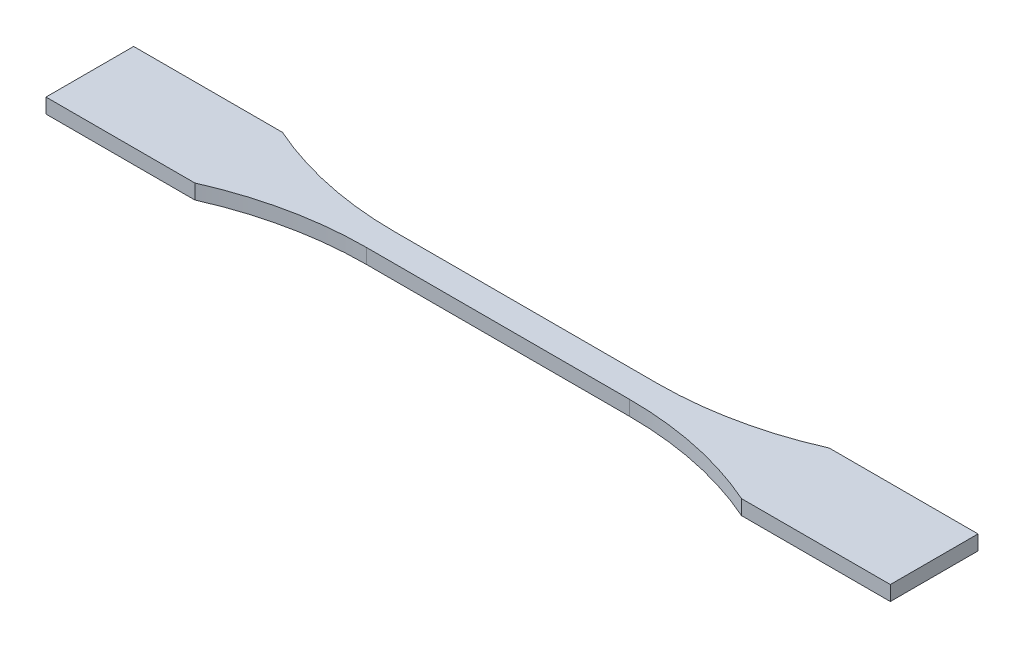
ISO-10303-21;
HEADER;
FILE_DESCRIPTION(('STEP AP214'),'2;1');
FILE_NAME('part.step','',(''),(''),'','','');
FILE_SCHEMA(('AUTOMOTIVE_DESIGN { 1 0 10303 214 1 1 1 1 }'));
ENDSEC;
DATA;
#1=APPLICATION_CONTEXT('core data for automotive mechanical design processes');
#2=APPLICATION_PROTOCOL_DEFINITION('international standard','automotive_design',2000,#1);
#3=PRODUCT_CONTEXT('',#1,'mechanical');
#4=PRODUCT('Part','Part','',(#3));
#5=PRODUCT_RELATED_PRODUCT_CATEGORY('part','',(#4));
#6=PRODUCT_DEFINITION_FORMATION('','',#4);
#7=PRODUCT_DEFINITION_CONTEXT('part definition',#1,'design');
#8=PRODUCT_DEFINITION('design','',#6,#7);
#9=PRODUCT_DEFINITION_SHAPE('','',#8);
#10=(LENGTH_UNIT() NAMED_UNIT(*) SI_UNIT(.MILLI.,.METRE.));
#11=(NAMED_UNIT(*) PLANE_ANGLE_UNIT() SI_UNIT($,.RADIAN.));
#12=(NAMED_UNIT(*) SI_UNIT($,.STERADIAN.) SOLID_ANGLE_UNIT());
#13=UNCERTAINTY_MEASURE_WITH_UNIT(LENGTH_MEASURE(1.E-05),#10,'distance_accuracy_value','');
#14=(GEOMETRIC_REPRESENTATION_CONTEXT(3) GLOBAL_UNCERTAINTY_ASSIGNED_CONTEXT((#13)) GLOBAL_UNIT_ASSIGNED_CONTEXT((#10,
#11,#12)) REPRESENTATION_CONTEXT('',''));
#15=CARTESIAN_POINT('',(0.,0.,0.));
#16=DIRECTION('',(0.,0.,1.));
#17=DIRECTION('',(1.,0.,0.));
#18=AXIS2_PLACEMENT_3D('',#15,#16,#17);
#19=CARTESIAN_POINT('',(-28.4999999999999,1.6,79.));
#20=DIRECTION('',(0.,-1.,0.));
#21=DIRECTION('',(0.,0.,-1.));
#22=AXIS2_PLACEMENT_3D('',#19,#20,#21);
#23=CYLINDRICAL_SURFACE('',#22,76.);
#24=CARTESIAN_POINT('',(-28.4999999999999,-1.6,79.));
#25=DIRECTION('',(0.,1.,0.));
#26=DIRECTION('',(0.,0.,1.));
#27=AXIS2_PLACEMENT_3D('',#24,#25,#26);
#28=CIRCLE('',#27,76.);
#29=CARTESIAN_POINT('',(-28.4999999999999,-1.6,3.));
#30=VERTEX_POINT('',#29);
#31=CARTESIAN_POINT('',(-59.2530486293635,-1.6,9.5));
#32=VERTEX_POINT('',#31);
#33=EDGE_CURVE('E154',#30,#32,#28,.T.);
#34=ORIENTED_EDGE('',*,*,#33,.F.);
#35=DIRECTION('',(0.,-1.,0.));
#36=VECTOR('',#35,1.);
#37=CARTESIAN_POINT('',(-28.4999999999999,1.6,3.));
#38=LINE('',#37,#36);
#39=CARTESIAN_POINT('',(-28.4999999999999,1.6,3.));
#40=VERTEX_POINT('',#39);
#41=EDGE_CURVE('E11',#40,#30,#38,.T.);
#42=ORIENTED_EDGE('',*,*,#41,.F.);
#43=CARTESIAN_POINT('',(-28.4999999999999,1.6,79.));
#44=DIRECTION('',(0.,1.,0.));
#45=DIRECTION('',(0.,0.,1.));
#46=AXIS2_PLACEMENT_3D('',#43,#44,#45);
#47=CIRCLE('',#46,76.);
#48=CARTESIAN_POINT('',(-59.2530486293635,1.6,9.5));
#49=VERTEX_POINT('',#48);
#50=EDGE_CURVE('E185',#40,#49,#47,.T.);
#51=ORIENTED_EDGE('',*,*,#50,.T.);
#52=DIRECTION('',(0.,-1.,0.));
#53=VECTOR('',#52,1.);
#54=CARTESIAN_POINT('',(-59.2530486293635,1.6,9.5));
#55=LINE('',#54,#53);
#56=EDGE_CURVE('E54',#49,#32,#55,.T.);
#57=ORIENTED_EDGE('',*,*,#56,.T.);
#58=EDGE_LOOP('',(#34,#42,#51,#57));
#59=FACE_BOUND('',#58,.T.);
#60=ADVANCED_FACE('F38',(#59),#23,.F.);
#61=CARTESIAN_POINT('',(0.,1.6,2.99999999999999));
#62=DIRECTION('',(0.,0.,1.));
#63=DIRECTION('',(1.,0.,0.));
#64=AXIS2_PLACEMENT_3D('',#61,#62,#63);
#65=PLANE('',#64);
#66=DIRECTION('',(-1.,0.,0.));
#67=VECTOR('',#66,1.);
#68=CARTESIAN_POINT('',(0.,-1.6,2.99999999999999));
#69=LINE('',#68,#67);
#70=CARTESIAN_POINT('',(28.5000000000001,-1.6,2.99999999999999));
#71=VERTEX_POINT('',#70);
#72=EDGE_CURVE('E156',#71,#30,#69,.T.);
#73=ORIENTED_EDGE('',*,*,#72,.F.);
#74=DIRECTION('',(0.,-1.,0.));
#75=VECTOR('',#74,1.);
#76=CARTESIAN_POINT('',(28.5000000000001,1.6,2.99999999999999));
#77=LINE('',#76,#75);
#78=CARTESIAN_POINT('',(28.5000000000001,1.6,2.99999999999999));
#79=VERTEX_POINT('',#78);
#80=EDGE_CURVE('E46',#79,#71,#77,.T.);
#81=ORIENTED_EDGE('',*,*,#80,.F.);
#82=DIRECTION('',(-1.,0.,0.));
#83=VECTOR('',#82,1.);
#84=CARTESIAN_POINT('',(0.,1.6,2.99999999999999));
#85=LINE('',#84,#83);
#86=EDGE_CURVE('E223',#79,#40,#85,.T.);
#87=ORIENTED_EDGE('',*,*,#86,.T.);
#88=ORIENTED_EDGE('',*,*,#41,.T.);
#89=EDGE_LOOP('',(#73,#81,#87,#88));
#90=FACE_BOUND('',#89,.T.);
#91=ADVANCED_FACE('F211',(#90),#65,.T.);
#92=CARTESIAN_POINT('',(28.5000000000001,1.6,79.));
#93=DIRECTION('',(0.,-1.,0.));
#94=DIRECTION('',(0.,0.,-1.));
#95=AXIS2_PLACEMENT_3D('',#92,#93,#94);
#96=CYLINDRICAL_SURFACE('',#95,76.);
#97=CARTESIAN_POINT('',(28.5000000000001,-1.6,79.));
#98=DIRECTION('',(0.,1.,0.));
#99=DIRECTION('',(0.,0.,1.));
#100=AXIS2_PLACEMENT_3D('',#97,#98,#99);
#101=CIRCLE('',#100,76.);
#102=CARTESIAN_POINT('',(59.2530486293637,-1.6,9.49999999999999));
#103=VERTEX_POINT('',#102);
#104=EDGE_CURVE('E159',#103,#71,#101,.T.);
#105=ORIENTED_EDGE('',*,*,#104,.F.);
#106=DIRECTION('',(0.,-1.,0.));
#107=VECTOR('',#106,1.);
#108=CARTESIAN_POINT('',(59.2530486293637,1.6,9.49999999999999));
#109=LINE('',#108,#107);
#110=CARTESIAN_POINT('',(59.2530486293637,1.6,9.49999999999999));
#111=VERTEX_POINT('',#110);
#112=EDGE_CURVE('E200',#111,#103,#109,.T.);
#113=ORIENTED_EDGE('',*,*,#112,.F.);
#114=CARTESIAN_POINT('',(28.5000000000001,1.6,79.));
#115=DIRECTION('',(0.,1.,0.));
#116=DIRECTION('',(0.,0.,1.));
#117=AXIS2_PLACEMENT_3D('',#114,#115,#116);
#118=CIRCLE('',#117,76.);
#119=EDGE_CURVE('E207',#111,#79,#118,.T.);
#120=ORIENTED_EDGE('',*,*,#119,.T.);
#121=ORIENTED_EDGE('',*,*,#80,.T.);
#122=EDGE_LOOP('',(#105,#113,#120,#121));
#123=FACE_BOUND('',#122,.T.);
#124=ADVANCED_FACE('F205',(#123),#96,.F.);
#125=CARTESIAN_POINT('',(0.,1.6,9.5));
#126=DIRECTION('',(0.,0.,1.));
#127=DIRECTION('',(1.,0.,0.));
#128=AXIS2_PLACEMENT_3D('',#125,#126,#127);
#129=PLANE('',#128);
#130=DIRECTION('',(-1.,0.,0.));
#131=VECTOR('',#130,1.);
#132=CARTESIAN_POINT('',(0.,-1.6,9.5));
#133=LINE('',#132,#131);
#134=CARTESIAN_POINT('',(91.4999999999999,-1.6,9.49999999999999));
#135=VERTEX_POINT('',#134);
#136=EDGE_CURVE('E162',#135,#103,#133,.T.);
#137=ORIENTED_EDGE('',*,*,#136,.F.);
#138=DIRECTION('',(0.,-1.,0.));
#139=VECTOR('',#138,1.);
#140=CARTESIAN_POINT('',(91.4999999999999,1.6,9.49999999999999));
#141=LINE('',#140,#139);
#142=CARTESIAN_POINT('',(91.4999999999999,1.6,9.49999999999999));
#143=VERTEX_POINT('',#142);
#144=EDGE_CURVE('E198',#143,#135,#141,.T.);
#145=ORIENTED_EDGE('',*,*,#144,.F.);
#146=DIRECTION('',(-1.,0.,0.));
#147=VECTOR('',#146,1.);
#148=CARTESIAN_POINT('',(0.,1.6,9.5));
#149=LINE('',#148,#147);
#150=EDGE_CURVE('E222',#143,#111,#149,.T.);
#151=ORIENTED_EDGE('',*,*,#150,.T.);
#152=ORIENTED_EDGE('',*,*,#112,.T.);
#153=EDGE_LOOP('',(#137,#145,#151,#152));
#154=FACE_BOUND('',#153,.T.);
#155=ADVANCED_FACE('F218',(#154),#129,.T.);
#156=CARTESIAN_POINT('',(91.4999999999999,1.6,0.));
#157=DIRECTION('',(-1.,0.,0.));
#158=DIRECTION('',(0.,0.,1.));
#159=AXIS2_PLACEMENT_3D('',#156,#157,#158);
#160=PLANE('',#159);
#161=DIRECTION('',(0.,0.,-1.));
#162=VECTOR('',#161,1.);
#163=CARTESIAN_POINT('',(91.4999999999999,-1.6,0.));
#164=LINE('',#163,#162);
#165=CARTESIAN_POINT('',(91.4999999999999,-1.6,-9.50000000000001));
#166=VERTEX_POINT('',#165);
#167=EDGE_CURVE('E165',#135,#166,#164,.T.);
#168=ORIENTED_EDGE('',*,*,#167,.T.);
#169=DIRECTION('',(0.,-1.,0.));
#170=VECTOR('',#169,1.);
#171=CARTESIAN_POINT('',(91.4999999999999,1.6,-9.50000000000001));
#172=LINE('',#171,#170);
#173=CARTESIAN_POINT('',(91.4999999999999,1.6,-9.50000000000001));
#174=VERTEX_POINT('',#173);
#175=EDGE_CURVE('E195',#174,#166,#172,.T.);
#176=ORIENTED_EDGE('',*,*,#175,.F.);
#177=DIRECTION('',(0.,0.,-1.));
#178=VECTOR('',#177,1.);
#179=CARTESIAN_POINT('',(91.4999999999999,1.6,0.));
#180=LINE('',#179,#178);
#181=EDGE_CURVE('E225',#143,#174,#180,.T.);
#182=ORIENTED_EDGE('',*,*,#181,.F.);
#183=ORIENTED_EDGE('',*,*,#144,.T.);
#184=EDGE_LOOP('',(#168,#176,#182,#183));
#185=FACE_BOUND('',#184,.T.);
#186=ADVANCED_FACE('F263',(#185),#160,.F.);
#187=CARTESIAN_POINT('',(0.,1.6,-9.5));
#188=DIRECTION('',(0.,0.,1.));
#189=DIRECTION('',(1.,0.,0.));
#190=AXIS2_PLACEMENT_3D('',#187,#188,#189);
#191=PLANE('',#190);
#192=DIRECTION('',(-1.,0.,0.));
#193=VECTOR('',#192,1.);
#194=CARTESIAN_POINT('',(0.,-1.6,-9.5));
#195=LINE('',#194,#193);
#196=CARTESIAN_POINT('',(59.2530486293636,-1.6,-9.5));
#197=VERTEX_POINT('',#196);
#198=EDGE_CURVE('E167',#166,#197,#195,.T.);
#199=ORIENTED_EDGE('',*,*,#198,.T.);
#200=DIRECTION('',(0.,-1.,0.));
#201=VECTOR('',#200,1.);
#202=CARTESIAN_POINT('',(59.2530486293636,1.6,-9.5));
#203=LINE('',#202,#201);
#204=CARTESIAN_POINT('',(59.2530486293636,1.6,-9.5));
#205=VERTEX_POINT('',#204);
#206=EDGE_CURVE('E193',#205,#197,#203,.T.);
#207=ORIENTED_EDGE('',*,*,#206,.F.);
#208=DIRECTION('',(-1.,0.,0.));
#209=VECTOR('',#208,1.);
#210=CARTESIAN_POINT('',(0.,1.6,-9.5));
#211=LINE('',#210,#209);
#212=EDGE_CURVE('E231',#174,#205,#211,.T.);
#213=ORIENTED_EDGE('',*,*,#212,.F.);
#214=ORIENTED_EDGE('',*,*,#175,.T.);
#215=EDGE_LOOP('',(#199,#207,#213,#214));
#216=FACE_BOUND('',#215,.T.);
#217=ADVANCED_FACE('F266',(#216),#191,.F.);
#218=CARTESIAN_POINT('',(28.5000000000001,1.6,-79.));
#219=DIRECTION('',(0.,-1.,0.));
#220=DIRECTION('',(0.,0.,-1.));
#221=AXIS2_PLACEMENT_3D('',#218,#219,#220);
#222=CYLINDRICAL_SURFACE('',#221,76.);
#223=CARTESIAN_POINT('',(28.5000000000001,-1.6,-79.));
#224=DIRECTION('',(0.,1.,0.));
#225=DIRECTION('',(0.,0.,1.));
#226=AXIS2_PLACEMENT_3D('',#223,#224,#225);
#227=CIRCLE('',#226,76.);
#228=CARTESIAN_POINT('',(28.5000000000001,-1.6,-3.00000000000001));
#229=VERTEX_POINT('',#228);
#230=EDGE_CURVE('E170',#229,#197,#227,.T.);
#231=ORIENTED_EDGE('',*,*,#230,.F.);
#232=DIRECTION('',(0.,-1.,0.));
#233=VECTOR('',#232,1.);
#234=CARTESIAN_POINT('',(28.5000000000001,1.6,-3.00000000000001));
#235=LINE('',#234,#233);
#236=CARTESIAN_POINT('',(28.5000000000001,1.6,-3.00000000000001));
#237=VERTEX_POINT('',#236);
#238=EDGE_CURVE('E191',#237,#229,#235,.T.);
#239=ORIENTED_EDGE('',*,*,#238,.F.);
#240=CARTESIAN_POINT('',(28.5000000000001,1.6,-79.));
#241=DIRECTION('',(0.,1.,0.));
#242=DIRECTION('',(0.,0.,1.));
#243=AXIS2_PLACEMENT_3D('',#240,#241,#242);
#244=CIRCLE('',#243,76.);
#245=EDGE_CURVE('E233',#237,#205,#244,.T.);
#246=ORIENTED_EDGE('',*,*,#245,.T.);
#247=ORIENTED_EDGE('',*,*,#206,.T.);
#248=EDGE_LOOP('',(#231,#239,#246,#247));
#249=FACE_BOUND('',#248,.T.);
#250=ADVANCED_FACE('F270',(#249),#222,.F.);
#251=CARTESIAN_POINT('',(0.,1.6,-3.00000000000001));
#252=DIRECTION('',(0.,0.,1.));
#253=DIRECTION('',(1.,0.,0.));
#254=AXIS2_PLACEMENT_3D('',#251,#252,#253);
#255=PLANE('',#254);
#256=DIRECTION('',(-1.,0.,0.));
#257=VECTOR('',#256,1.);
#258=CARTESIAN_POINT('',(0.,-1.6,-3.00000000000001));
#259=LINE('',#258,#257);
#260=CARTESIAN_POINT('',(-28.4999999999999,-1.6,-3.));
#261=VERTEX_POINT('',#260);
#262=EDGE_CURVE('E173',#229,#261,#259,.T.);
#263=ORIENTED_EDGE('',*,*,#262,.T.);
#264=DIRECTION('',(0.,-1.,0.));
#265=VECTOR('',#264,1.);
#266=CARTESIAN_POINT('',(-28.4999999999999,1.6,-3.));
#267=LINE('',#266,#265);
#268=CARTESIAN_POINT('',(-28.4999999999999,1.6,-3.));
#269=VERTEX_POINT('',#268);
#270=EDGE_CURVE('E189',#269,#261,#267,.T.);
#271=ORIENTED_EDGE('',*,*,#270,.F.);
#272=DIRECTION('',(-1.,0.,0.));
#273=VECTOR('',#272,1.);
#274=CARTESIAN_POINT('',(0.,1.6,-3.00000000000001));
#275=LINE('',#274,#273);
#276=EDGE_CURVE('E236',#237,#269,#275,.T.);
#277=ORIENTED_EDGE('',*,*,#276,.F.);
#278=ORIENTED_EDGE('',*,*,#238,.T.);
#279=EDGE_LOOP('',(#263,#271,#277,#278));
#280=FACE_BOUND('',#279,.T.);
#281=ADVANCED_FACE('F274',(#280),#255,.F.);
#282=CARTESIAN_POINT('',(-28.4999999999999,1.6,-79.));
#283=DIRECTION('',(0.,-1.,0.));
#284=DIRECTION('',(0.,0.,-1.));
#285=AXIS2_PLACEMENT_3D('',#282,#283,#284);
#286=CYLINDRICAL_SURFACE('',#285,76.);
#287=CARTESIAN_POINT('',(-28.4999999999999,-1.6,-79.));
#288=DIRECTION('',(0.,1.,0.));
#289=DIRECTION('',(0.,0.,1.));
#290=AXIS2_PLACEMENT_3D('',#287,#288,#289);
#291=CIRCLE('',#290,76.);
#292=CARTESIAN_POINT('',(-59.2530486293634,-1.6,-9.49999999999999));
#293=VERTEX_POINT('',#292);
#294=EDGE_CURVE('E176',#293,#261,#291,.T.);
#295=ORIENTED_EDGE('',*,*,#294,.F.);
#296=DIRECTION('',(0.,-1.,0.));
#297=VECTOR('',#296,1.);
#298=CARTESIAN_POINT('',(-59.2530486293634,1.6,-9.49999999999999));
#299=LINE('',#298,#297);
#300=CARTESIAN_POINT('',(-59.2530486293634,1.6,-9.49999999999999));
#301=VERTEX_POINT('',#300);
#302=EDGE_CURVE('E146',#301,#293,#299,.T.);
#303=ORIENTED_EDGE('',*,*,#302,.F.);
#304=CARTESIAN_POINT('',(-28.4999999999999,1.6,-79.));
#305=DIRECTION('',(0.,1.,0.));
#306=DIRECTION('',(0.,0.,1.));
#307=AXIS2_PLACEMENT_3D('',#304,#305,#306);
#308=CIRCLE('',#307,76.);
#309=EDGE_CURVE('E136',#301,#269,#308,.T.);
#310=ORIENTED_EDGE('',*,*,#309,.T.);
#311=ORIENTED_EDGE('',*,*,#270,.T.);
#312=EDGE_LOOP('',(#295,#303,#310,#311));
#313=FACE_BOUND('',#312,.T.);
#314=ADVANCED_FACE('F239',(#313),#286,.F.);
#315=CARTESIAN_POINT('',(0.,1.6,-9.5));
#316=DIRECTION('',(0.,0.,1.));
#317=DIRECTION('',(1.,0.,0.));
#318=AXIS2_PLACEMENT_3D('',#315,#316,#317);
#319=PLANE('',#318);
#320=DIRECTION('',(-1.,0.,0.));
#321=VECTOR('',#320,1.);
#322=CARTESIAN_POINT('',(0.,-1.6,-9.5));
#323=LINE('',#322,#321);
#324=CARTESIAN_POINT('',(-91.5000000000001,-1.6,-9.49999999999999));
#325=VERTEX_POINT('',#324);
#326=EDGE_CURVE('E143',#293,#325,#323,.T.);
#327=ORIENTED_EDGE('',*,*,#326,.T.);
#328=DIRECTION('',(0.,-1.,0.));
#329=VECTOR('',#328,1.);
#330=CARTESIAN_POINT('',(-91.5000000000001,1.6,-9.49999999999999));
#331=LINE('',#330,#329);
#332=CARTESIAN_POINT('',(-91.5000000000001,1.6,-9.49999999999999));
#333=VERTEX_POINT('',#332);
#334=EDGE_CURVE('E140',#333,#325,#331,.T.);
#335=ORIENTED_EDGE('',*,*,#334,.F.);
#336=DIRECTION('',(-1.,0.,0.));
#337=VECTOR('',#336,1.);
#338=CARTESIAN_POINT('',(0.,1.6,-9.5));
#339=LINE('',#338,#337);
#340=EDGE_CURVE('E129',#301,#333,#339,.T.);
#341=ORIENTED_EDGE('',*,*,#340,.F.);
#342=ORIENTED_EDGE('',*,*,#302,.T.);
#343=EDGE_LOOP('',(#327,#335,#341,#342));
#344=FACE_BOUND('',#343,.T.);
#345=ADVANCED_FACE('F141',(#344),#319,.F.);
#346=CARTESIAN_POINT('',(-91.5000000000001,1.6,0.));
#347=DIRECTION('',(-1.,0.,0.));
#348=DIRECTION('',(0.,0.,1.));
#349=AXIS2_PLACEMENT_3D('',#346,#347,#348);
#350=PLANE('',#349);
#351=DIRECTION('',(0.,0.,-1.));
#352=VECTOR('',#351,1.);
#353=CARTESIAN_POINT('',(-91.5000000000001,-1.6,0.));
#354=LINE('',#353,#352);
#355=CARTESIAN_POINT('',(-91.5000000000001,-1.6,9.50000000000001));
#356=VERTEX_POINT('',#355);
#357=EDGE_CURVE('E180',#356,#325,#354,.T.);
#358=ORIENTED_EDGE('',*,*,#357,.F.);
#359=DIRECTION('',(0.,-1.,0.));
#360=VECTOR('',#359,1.);
#361=CARTESIAN_POINT('',(-91.5000000000001,1.6,9.50000000000001));
#362=LINE('',#361,#360);
#363=CARTESIAN_POINT('',(-91.5000000000001,1.6,9.50000000000001));
#364=VERTEX_POINT('',#363);
#365=EDGE_CURVE('E91',#364,#356,#362,.T.);
#366=ORIENTED_EDGE('',*,*,#365,.F.);
#367=DIRECTION('',(0.,0.,-1.));
#368=VECTOR('',#367,1.);
#369=CARTESIAN_POINT('',(-91.5000000000001,1.6,0.));
#370=LINE('',#369,#368);
#371=EDGE_CURVE('E134',#364,#333,#370,.T.);
#372=ORIENTED_EDGE('',*,*,#371,.T.);
#373=ORIENTED_EDGE('',*,*,#334,.T.);
#374=EDGE_LOOP('',(#358,#366,#372,#373));
#375=FACE_BOUND('',#374,.T.);
#376=ADVANCED_FACE('F148',(#375),#350,.T.);
#377=CARTESIAN_POINT('',(0.,1.6,9.5));
#378=DIRECTION('',(0.,0.,1.));
#379=DIRECTION('',(1.,0.,0.));
#380=AXIS2_PLACEMENT_3D('',#377,#378,#379);
#381=PLANE('',#380);
#382=DIRECTION('',(-1.,0.,0.));
#383=VECTOR('',#382,1.);
#384=CARTESIAN_POINT('',(0.,-1.6,9.5));
#385=LINE('',#384,#383);
#386=EDGE_CURVE('E182',#32,#356,#385,.T.);
#387=ORIENTED_EDGE('',*,*,#386,.F.);
#388=ORIENTED_EDGE('',*,*,#56,.F.);
#389=DIRECTION('',(-1.,0.,0.));
#390=VECTOR('',#389,1.);
#391=CARTESIAN_POINT('',(0.,1.6,9.5));
#392=LINE('',#391,#390);
#393=EDGE_CURVE('E149',#49,#364,#392,.T.);
#394=ORIENTED_EDGE('',*,*,#393,.T.);
#395=ORIENTED_EDGE('',*,*,#365,.T.);
#396=EDGE_LOOP('',(#387,#388,#394,#395));
#397=FACE_BOUND('',#396,.T.);
#398=ADVANCED_FACE('F242',(#397),#381,.T.);
#399=CARTESIAN_POINT('',(0.,1.6,0.));
#400=DIRECTION('',(0.,1.,0.));
#401=DIRECTION('',(0.,0.,1.));
#402=AXIS2_PLACEMENT_3D('',#399,#400,#401);
#403=PLANE('',#402);
#404=ORIENTED_EDGE('',*,*,#50,.F.);
#405=ORIENTED_EDGE('',*,*,#86,.F.);
#406=ORIENTED_EDGE('',*,*,#119,.F.);
#407=ORIENTED_EDGE('',*,*,#150,.F.);
#408=ORIENTED_EDGE('',*,*,#181,.T.);
#409=ORIENTED_EDGE('',*,*,#212,.T.);
#410=ORIENTED_EDGE('',*,*,#245,.F.);
#411=ORIENTED_EDGE('',*,*,#276,.T.);
#412=ORIENTED_EDGE('',*,*,#309,.F.);
#413=ORIENTED_EDGE('',*,*,#340,.T.);
#414=ORIENTED_EDGE('',*,*,#371,.F.);
#415=ORIENTED_EDGE('',*,*,#393,.F.);
#416=EDGE_LOOP('',(#404,#405,#406,#407,#408,#409,#410,#411,#412,#413,#414,#415));
#417=FACE_BOUND('',#416,.T.);
#418=ADVANCED_FACE('F131',(#417),#403,.T.);
#419=CARTESIAN_POINT('',(0.,-1.6,0.));
#420=DIRECTION('',(0.,1.,0.));
#421=DIRECTION('',(0.,0.,1.));
#422=AXIS2_PLACEMENT_3D('',#419,#420,#421);
#423=PLANE('',#422);
#424=ORIENTED_EDGE('',*,*,#33,.T.);
#425=ORIENTED_EDGE('',*,*,#386,.T.);
#426=ORIENTED_EDGE('',*,*,#357,.T.);
#427=ORIENTED_EDGE('',*,*,#326,.F.);
#428=ORIENTED_EDGE('',*,*,#294,.T.);
#429=ORIENTED_EDGE('',*,*,#262,.F.);
#430=ORIENTED_EDGE('',*,*,#230,.T.);
#431=ORIENTED_EDGE('',*,*,#198,.F.);
#432=ORIENTED_EDGE('',*,*,#167,.F.);
#433=ORIENTED_EDGE('',*,*,#136,.T.);
#434=ORIENTED_EDGE('',*,*,#104,.T.);
#435=ORIENTED_EDGE('',*,*,#72,.T.);
#436=EDGE_LOOP('',(#424,#425,#426,#427,#428,#429,#430,#431,#432,#433,#434,#435));
#437=FACE_BOUND('',#436,.T.);
#438=ADVANCED_FACE('F213',(#437),#423,.F.);
#439=CLOSED_SHELL('',(#60,#91,#124,#155,#186,#217,#250,#281,#314,#345,#376,#398,#418,#438));
#440=MANIFOLD_SOLID_BREP('B2',#439);
#441=ADVANCED_BREP_SHAPE_REPRESENTATION('',(#18,#440),#14);
#442=SHAPE_DEFINITION_REPRESENTATION(#9,#441);
ENDSEC;
END-ISO-10303-21;
